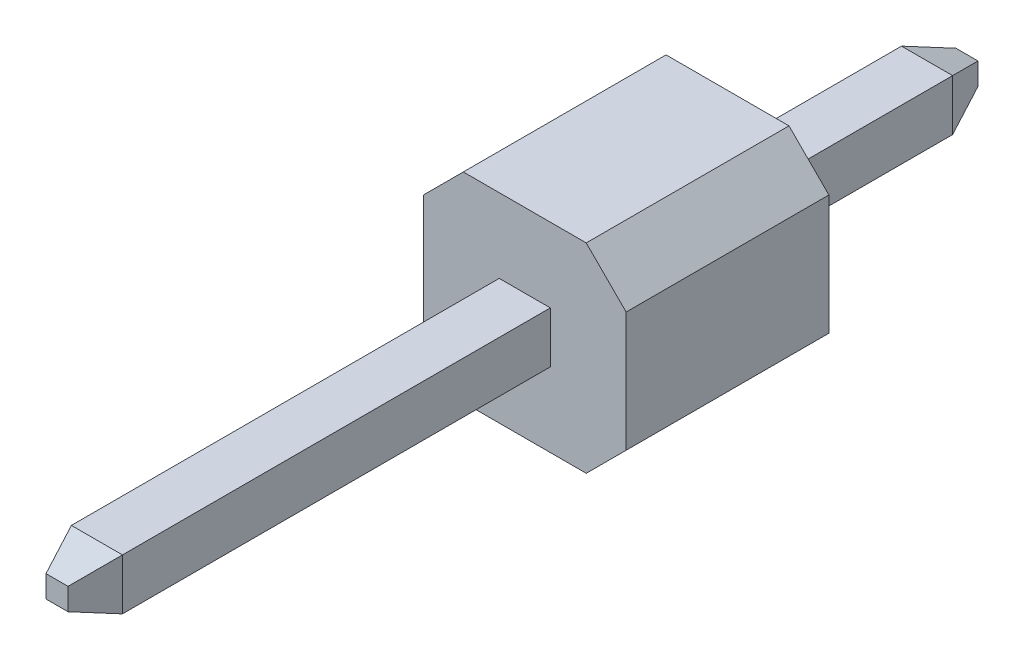
ISO-10303-21;
HEADER;
FILE_DESCRIPTION(('STEP AP214'),'2;1');
FILE_NAME('part.step','',(''),(''),'','','');
FILE_SCHEMA(('AUTOMOTIVE_DESIGN { 1 0 10303 214 1 1 1 1 }'));
ENDSEC;
DATA;
#1=APPLICATION_CONTEXT('core data for automotive mechanical design processes');
#2=APPLICATION_PROTOCOL_DEFINITION('international standard','automotive_design',2000,#1);
#3=PRODUCT_CONTEXT('',#1,'mechanical');
#4=PRODUCT('Part','Part','',(#3));
#5=PRODUCT_RELATED_PRODUCT_CATEGORY('part','',(#4));
#6=PRODUCT_DEFINITION_FORMATION('','',#4);
#7=PRODUCT_DEFINITION_CONTEXT('part definition',#1,'design');
#8=PRODUCT_DEFINITION('design','',#6,#7);
#9=PRODUCT_DEFINITION_SHAPE('','',#8);
#10=(LENGTH_UNIT() NAMED_UNIT(*) SI_UNIT(.MILLI.,.METRE.));
#11=(NAMED_UNIT(*) PLANE_ANGLE_UNIT() SI_UNIT($,.RADIAN.));
#12=(NAMED_UNIT(*) SI_UNIT($,.STERADIAN.) SOLID_ANGLE_UNIT());
#13=UNCERTAINTY_MEASURE_WITH_UNIT(LENGTH_MEASURE(1.E-05),#10,'distance_accuracy_value','');
#14=(GEOMETRIC_REPRESENTATION_CONTEXT(3) GLOBAL_UNCERTAINTY_ASSIGNED_CONTEXT((#13)) GLOBAL_UNIT_ASSIGNED_CONTEXT((#10,
#11,#12)) REPRESENTATION_CONTEXT('',''));
#15=CARTESIAN_POINT('',(0.,0.,0.));
#16=DIRECTION('',(0.,0.,1.));
#17=DIRECTION('',(1.,0.,0.));
#18=AXIS2_PLACEMENT_3D('',#15,#16,#17);
#19=CARTESIAN_POINT('',(-0.32,0.32,8.4));
#20=DIRECTION('',(1.,0.,0.));
#21=DIRECTION('',(0.,1.,0.));
#22=AXIS2_PLACEMENT_3D('',#19,#20,#21);
#23=PLANE('',#22);
#24=DIRECTION('',(0.,0.,-1.));
#25=VECTOR('',#24,1.);
#26=CARTESIAN_POINT('',(-0.32,0.32,8.4));
#27=LINE('',#26,#25);
#28=CARTESIAN_POINT('',(-0.32,0.32,7.9));
#29=VERTEX_POINT('',#28);
#30=CARTESIAN_POINT('',(-0.32,0.32,2.54));
#31=VERTEX_POINT('',#30);
#32=EDGE_CURVE('E183',#29,#31,#27,.T.);
#33=ORIENTED_EDGE('',*,*,#32,.T.);
#34=DIRECTION('',(0.,-1.,0.));
#35=VECTOR('',#34,1.);
#36=CARTESIAN_POINT('',(-0.32,0.32,2.54));
#37=LINE('',#36,#35);
#38=CARTESIAN_POINT('',(-0.32,-0.32,2.54));
#39=VERTEX_POINT('',#38);
#40=EDGE_CURVE('E281',#31,#39,#37,.T.);
#41=ORIENTED_EDGE('',*,*,#40,.T.);
#42=DIRECTION('',(0.,0.,-1.));
#43=VECTOR('',#42,1.);
#44=CARTESIAN_POINT('',(-0.32,-0.32,8.4));
#45=LINE('',#44,#43);
#46=CARTESIAN_POINT('',(-0.32,-0.32,7.9));
#47=VERTEX_POINT('',#46);
#48=EDGE_CURVE('E294',#47,#39,#45,.T.);
#49=ORIENTED_EDGE('',*,*,#48,.F.);
#50=DIRECTION('',(0.,1.,0.));
#51=VECTOR('',#50,1.);
#52=CARTESIAN_POINT('',(-0.32,0.32,7.9));
#53=LINE('',#52,#51);
#54=EDGE_CURVE('E309',#47,#29,#53,.T.);
#55=ORIENTED_EDGE('',*,*,#54,.T.);
#56=EDGE_LOOP('',(#33,#41,#49,#55));
#57=FACE_BOUND('',#56,.T.);
#58=ADVANCED_FACE('F34',(#57),#23,.F.);
#59=CARTESIAN_POINT('',(-0.32,-0.32,8.4));
#60=DIRECTION('',(0.,1.,0.));
#61=DIRECTION('',(0.,0.,1.));
#62=AXIS2_PLACEMENT_3D('',#59,#60,#61);
#63=PLANE('',#62);
#64=ORIENTED_EDGE('',*,*,#48,.T.);
#65=DIRECTION('',(1.,0.,0.));
#66=VECTOR('',#65,1.);
#67=CARTESIAN_POINT('',(-0.32,-0.32,2.54));
#68=LINE('',#67,#66);
#69=CARTESIAN_POINT('',(0.32,-0.32,2.54));
#70=VERTEX_POINT('',#69);
#71=EDGE_CURVE('E278',#39,#70,#68,.T.);
#72=ORIENTED_EDGE('',*,*,#71,.T.);
#73=DIRECTION('',(0.,0.,-1.));
#74=VECTOR('',#73,1.);
#75=CARTESIAN_POINT('',(0.32,-0.32,8.4));
#76=LINE('',#75,#74);
#77=CARTESIAN_POINT('',(0.32,-0.32,7.9));
#78=VERTEX_POINT('',#77);
#79=EDGE_CURVE('E291',#78,#70,#76,.T.);
#80=ORIENTED_EDGE('',*,*,#79,.F.);
#81=DIRECTION('',(-1.,0.,0.));
#82=VECTOR('',#81,1.);
#83=CARTESIAN_POINT('',(-0.32,-0.32,7.9));
#84=LINE('',#83,#82);
#85=EDGE_CURVE('E319',#78,#47,#84,.T.);
#86=ORIENTED_EDGE('',*,*,#85,.T.);
#87=EDGE_LOOP('',(#64,#72,#80,#86));
#88=FACE_BOUND('',#87,.T.);
#89=ADVANCED_FACE('F368',(#88),#63,.F.);
#90=CARTESIAN_POINT('',(0.32,0.32,8.4));
#91=DIRECTION('',(-1.,0.,0.));
#92=DIRECTION('',(0.,0.,1.));
#93=AXIS2_PLACEMENT_3D('',#90,#91,#92);
#94=PLANE('',#93);
#95=ORIENTED_EDGE('',*,*,#79,.T.);
#96=DIRECTION('',(0.,1.,0.));
#97=VECTOR('',#96,1.);
#98=CARTESIAN_POINT('',(0.32,0.32,2.54));
#99=LINE('',#98,#97);
#100=CARTESIAN_POINT('',(0.32,0.32,2.54));
#101=VERTEX_POINT('',#100);
#102=EDGE_CURVE('E193',#70,#101,#99,.T.);
#103=ORIENTED_EDGE('',*,*,#102,.T.);
#104=DIRECTION('',(0.,0.,-1.));
#105=VECTOR('',#104,1.);
#106=CARTESIAN_POINT('',(0.32,0.32,8.4));
#107=LINE('',#106,#105);
#108=CARTESIAN_POINT('',(0.32,0.32,7.9));
#109=VERTEX_POINT('',#108);
#110=EDGE_CURVE('E287',#109,#101,#107,.T.);
#111=ORIENTED_EDGE('',*,*,#110,.F.);
#112=DIRECTION('',(0.,-1.,0.));
#113=VECTOR('',#112,1.);
#114=CARTESIAN_POINT('',(0.32,-0.32,7.9));
#115=LINE('',#114,#113);
#116=EDGE_CURVE('E313',#109,#78,#115,.T.);
#117=ORIENTED_EDGE('',*,*,#116,.T.);
#118=EDGE_LOOP('',(#95,#103,#111,#117));
#119=FACE_BOUND('',#118,.T.);
#120=ADVANCED_FACE('F364',(#119),#94,.F.);
#121=CARTESIAN_POINT('',(-0.32,0.32,8.4));
#122=DIRECTION('',(0.,-1.,0.));
#123=DIRECTION('',(0.,0.,-1.));
#124=AXIS2_PLACEMENT_3D('',#121,#122,#123);
#125=PLANE('',#124);
#126=ORIENTED_EDGE('',*,*,#110,.T.);
#127=DIRECTION('',(-1.,0.,0.));
#128=VECTOR('',#127,1.);
#129=CARTESIAN_POINT('',(-0.32,0.32,2.54));
#130=LINE('',#129,#128);
#131=EDGE_CURVE('E199',#101,#31,#130,.T.);
#132=ORIENTED_EDGE('',*,*,#131,.T.);
#133=ORIENTED_EDGE('',*,*,#32,.F.);
#134=DIRECTION('',(1.,0.,0.));
#135=VECTOR('',#134,1.);
#136=CARTESIAN_POINT('',(0.32,0.32,7.9));
#137=LINE('',#136,#135);
#138=EDGE_CURVE('E306',#29,#109,#137,.T.);
#139=ORIENTED_EDGE('',*,*,#138,.T.);
#140=EDGE_LOOP('',(#126,#132,#133,#139));
#141=FACE_BOUND('',#140,.T.);
#142=ADVANCED_FACE('F361',(#141),#125,.F.);
#143=CARTESIAN_POINT('',(0.,0.,8.4));
#144=DIRECTION('',(0.,0.,1.));
#145=DIRECTION('',(1.,0.,0.));
#146=AXIS2_PLACEMENT_3D('',#143,#144,#145);
#147=PLANE('',#146);
#148=DIRECTION('',(1.,0.,0.));
#149=VECTOR('',#148,1.);
#150=CARTESIAN_POINT('',(0.32,-0.138014882866899,8.4));
#151=LINE('',#150,#149);
#152=CARTESIAN_POINT('',(-0.138014882866899,-0.138014882866899,8.4));
#153=VERTEX_POINT('',#152);
#154=CARTESIAN_POINT('',(0.138014882866899,-0.138014882866899,8.4));
#155=VERTEX_POINT('',#154);
#156=EDGE_CURVE('E324',#153,#155,#151,.T.);
#157=ORIENTED_EDGE('',*,*,#156,.T.);
#158=DIRECTION('',(0.,1.,0.));
#159=VECTOR('',#158,1.);
#160=CARTESIAN_POINT('',(0.138014882866899,0.32,8.4));
#161=LINE('',#160,#159);
#162=CARTESIAN_POINT('',(0.138014882866899,0.138014882866899,8.4));
#163=VERTEX_POINT('',#162);
#164=EDGE_CURVE('E200',#155,#163,#161,.T.);
#165=ORIENTED_EDGE('',*,*,#164,.T.);
#166=DIRECTION('',(-1.,0.,0.));
#167=VECTOR('',#166,1.);
#168=CARTESIAN_POINT('',(-0.32,0.138014882866899,8.4));
#169=LINE('',#168,#167);
#170=CARTESIAN_POINT('',(-0.138014882866899,0.138014882866899,8.4));
#171=VERTEX_POINT('',#170);
#172=EDGE_CURVE('E206',#163,#171,#169,.T.);
#173=ORIENTED_EDGE('',*,*,#172,.T.);
#174=DIRECTION('',(0.,-1.,0.));
#175=VECTOR('',#174,1.);
#176=CARTESIAN_POINT('',(-0.138014882866899,-0.32,8.4));
#177=LINE('',#176,#175);
#178=EDGE_CURVE('E326',#171,#153,#177,.T.);
#179=ORIENTED_EDGE('',*,*,#178,.T.);
#180=EDGE_LOOP('',(#157,#165,#173,#179));
#181=FACE_BOUND('',#180,.T.);
#182=ADVANCED_FACE('F429',(#181),#147,.T.);
#183=CARTESIAN_POINT('',(-0.138014882866899,0.,8.4));
#184=DIRECTION('',(-0.939692620785909,0.,0.342020143325666));
#185=DIRECTION('',(0.,1.,0.));
#186=AXIS2_PLACEMENT_3D('',#183,#184,#185);
#187=PLANE('',#186);
#188=DIRECTION('',(-0.323615577118182,0.323615577118182,-0.88912649071599));
#189=VECTOR('',#188,1.);
#190=CARTESIAN_POINT('',(-0.123560992466288,0.123560992466288,8.43971173749895));
#191=LINE('',#190,#189);
#192=EDGE_CURVE('E340',#29,#171,#191,.F.);
#193=ORIENTED_EDGE('',*,*,#192,.F.);
#194=ORIENTED_EDGE('',*,*,#54,.F.);
#195=DIRECTION('',(-0.323615577118182,-0.323615577118182,-0.88912649071599));
#196=VECTOR('',#195,1.);
#197=CARTESIAN_POINT('',(-0.123560992466288,-0.123560992466288,8.43971173749895));
#198=LINE('',#197,#196);
#199=EDGE_CURVE('E209',#153,#47,#198,.T.);
#200=ORIENTED_EDGE('',*,*,#199,.F.);
#201=ORIENTED_EDGE('',*,*,#178,.F.);
#202=EDGE_LOOP('',(#193,#194,#200,#201));
#203=FACE_BOUND('',#202,.T.);
#204=ADVANCED_FACE('F356',(#203),#187,.T.);
#205=CARTESIAN_POINT('',(0.,-0.138014882866899,8.4));
#206=DIRECTION('',(0.,-0.939692620785909,0.342020143325666));
#207=DIRECTION('',(-1.,0.,0.));
#208=AXIS2_PLACEMENT_3D('',#205,#206,#207);
#209=PLANE('',#208);
#210=ORIENTED_EDGE('',*,*,#199,.T.);
#211=ORIENTED_EDGE('',*,*,#85,.F.);
#212=DIRECTION('',(-0.323615577118182,0.323615577118182,0.88912649071599));
#213=VECTOR('',#212,1.);
#214=CARTESIAN_POINT('',(0.123560992466288,-0.123560992466288,8.43971173749895));
#215=LINE('',#214,#213);
#216=EDGE_CURVE('E339',#155,#78,#215,.F.);
#217=ORIENTED_EDGE('',*,*,#216,.F.);
#218=ORIENTED_EDGE('',*,*,#156,.F.);
#219=EDGE_LOOP('',(#210,#211,#217,#218));
#220=FACE_BOUND('',#219,.T.);
#221=ADVANCED_FACE('F351',(#220),#209,.T.);
#222=CARTESIAN_POINT('',(0.,0.138014882866899,8.4));
#223=DIRECTION('',(0.,0.939692620785909,0.342020143325666));
#224=DIRECTION('',(1.,0.,0.));
#225=AXIS2_PLACEMENT_3D('',#222,#223,#224);
#226=PLANE('',#225);
#227=ORIENTED_EDGE('',*,*,#192,.T.);
#228=ORIENTED_EDGE('',*,*,#172,.F.);
#229=DIRECTION('',(0.323615577118182,0.323615577118182,-0.88912649071599));
#230=VECTOR('',#229,1.);
#231=CARTESIAN_POINT('',(0.123560992466288,0.123560992466288,8.43971173749895));
#232=LINE('',#231,#230);
#233=EDGE_CURVE('E283',#109,#163,#232,.F.);
#234=ORIENTED_EDGE('',*,*,#233,.F.);
#235=ORIENTED_EDGE('',*,*,#138,.F.);
#236=EDGE_LOOP('',(#227,#228,#234,#235));
#237=FACE_BOUND('',#236,.T.);
#238=ADVANCED_FACE('F421',(#237),#226,.T.);
#239=CARTESIAN_POINT('',(0.138014882866899,0.,8.4));
#240=DIRECTION('',(0.939692620785909,0.,0.342020143325666));
#241=DIRECTION('',(0.,-1.,0.));
#242=AXIS2_PLACEMENT_3D('',#239,#240,#241);
#243=PLANE('',#242);
#244=ORIENTED_EDGE('',*,*,#216,.T.);
#245=ORIENTED_EDGE('',*,*,#116,.F.);
#246=ORIENTED_EDGE('',*,*,#233,.T.);
#247=ORIENTED_EDGE('',*,*,#164,.F.);
#248=EDGE_LOOP('',(#244,#245,#246,#247));
#249=FACE_BOUND('',#248,.T.);
#250=ADVANCED_FACE('F418',(#249),#243,.T.);
#251=CARTESIAN_POINT('',(0.,0.,2.54));
#252=DIRECTION('',(0.,0.,1.));
#253=DIRECTION('',(1.,0.,0.));
#254=AXIS2_PLACEMENT_3D('',#251,#252,#253);
#255=PLANE('',#254);
#256=DIRECTION('',(0.,1.,0.));
#257=VECTOR('',#256,1.);
#258=CARTESIAN_POINT('',(1.27,1.25,2.54));
#259=LINE('',#258,#257);
#260=CARTESIAN_POINT('',(1.27,-0.749999999999998,2.54));
#261=VERTEX_POINT('',#260);
#262=CARTESIAN_POINT('',(1.27,0.75,2.54));
#263=VERTEX_POINT('',#262);
#264=EDGE_CURVE('E453',#261,#263,#259,.T.);
#265=ORIENTED_EDGE('',*,*,#264,.T.);
#266=DIRECTION('',(0.707106781186548,-0.707106781186548,0.));
#267=VECTOR('',#266,1.);
#268=CARTESIAN_POINT('',(1.01,1.01,2.54));
#269=LINE('',#268,#267);
#270=CARTESIAN_POINT('',(0.77,1.25,2.54));
#271=VERTEX_POINT('',#270);
#272=EDGE_CURVE('E234',#263,#271,#269,.F.);
#273=ORIENTED_EDGE('',*,*,#272,.T.);
#274=DIRECTION('',(-1.,0.,0.));
#275=VECTOR('',#274,1.);
#276=CARTESIAN_POINT('',(-1.27,1.25,2.54));
#277=LINE('',#276,#275);
#278=CARTESIAN_POINT('',(-0.769999999999998,1.25,2.54));
#279=VERTEX_POINT('',#278);
#280=EDGE_CURVE('E274',#271,#279,#277,.T.);
#281=ORIENTED_EDGE('',*,*,#280,.T.);
#282=DIRECTION('',(0.70710678118655,0.707106781186545,0.));
#283=VECTOR('',#282,1.);
#284=CARTESIAN_POINT('',(-1.01,1.01,2.54));
#285=LINE('',#284,#283);
#286=CARTESIAN_POINT('',(-1.27,0.750000000000001,2.54));
#287=VERTEX_POINT('',#286);
#288=EDGE_CURVE('E230',#279,#287,#285,.F.);
#289=ORIENTED_EDGE('',*,*,#288,.T.);
#290=DIRECTION('',(0.,-1.,0.));
#291=VECTOR('',#290,1.);
#292=CARTESIAN_POINT('',(-1.27,1.25,2.54));
#293=LINE('',#292,#291);
#294=CARTESIAN_POINT('',(-1.27,-0.749999999999996,2.54));
#295=VERTEX_POINT('',#294);
#296=EDGE_CURVE('E244',#287,#295,#293,.T.);
#297=ORIENTED_EDGE('',*,*,#296,.T.);
#298=DIRECTION('',(-0.707106781186546,0.707106781186549,0.));
#299=VECTOR('',#298,1.);
#300=CARTESIAN_POINT('',(-1.01,-1.01,2.54));
#301=LINE('',#300,#299);
#302=CARTESIAN_POINT('',(-0.769999999999998,-1.25,2.54));
#303=VERTEX_POINT('',#302);
#304=EDGE_CURVE('E56',#295,#303,#301,.F.);
#305=ORIENTED_EDGE('',*,*,#304,.T.);
#306=DIRECTION('',(1.,0.,0.));
#307=VECTOR('',#306,1.);
#308=CARTESIAN_POINT('',(-1.27,-1.25,2.54));
#309=LINE('',#308,#307);
#310=CARTESIAN_POINT('',(0.769999999999996,-1.25,2.54));
#311=VERTEX_POINT('',#310);
#312=EDGE_CURVE('E254',#303,#311,#309,.T.);
#313=ORIENTED_EDGE('',*,*,#312,.T.);
#314=DIRECTION('',(-0.707106781186549,-0.707106781186546,0.));
#315=VECTOR('',#314,1.);
#316=CARTESIAN_POINT('',(1.01,-1.01,2.54));
#317=LINE('',#316,#315);
#318=EDGE_CURVE('E232',#311,#261,#317,.F.);
#319=ORIENTED_EDGE('',*,*,#318,.T.);
#320=EDGE_LOOP('',(#265,#273,#281,#289,#297,#305,#313,#319));
#321=FACE_BOUND('',#320,.T.);
#322=ORIENTED_EDGE('',*,*,#40,.F.);
#323=ORIENTED_EDGE('',*,*,#131,.F.);
#324=ORIENTED_EDGE('',*,*,#102,.F.);
#325=ORIENTED_EDGE('',*,*,#71,.F.);
#326=EDGE_LOOP('',(#322,#323,#324,#325));
#327=FACE_BOUND('',#326,.T.);
#328=ADVANCED_FACE('F250',(#321,#327),#255,.T.);
#329=CARTESIAN_POINT('',(0.,0.,0.));
#330=DIRECTION('',(0.,0.,1.));
#331=DIRECTION('',(1.,0.,0.));
#332=AXIS2_PLACEMENT_3D('',#329,#330,#331);
#333=PLANE('',#332);
#334=DIRECTION('',(-1.,0.,0.));
#335=VECTOR('',#334,1.);
#336=CARTESIAN_POINT('',(-1.27,1.25,0.));
#337=LINE('',#336,#335);
#338=CARTESIAN_POINT('',(0.77,1.25,0.));
#339=VERTEX_POINT('',#338);
#340=CARTESIAN_POINT('',(-0.769999999999998,1.25,0.));
#341=VERTEX_POINT('',#340);
#342=EDGE_CURVE('E255',#339,#341,#337,.T.);
#343=ORIENTED_EDGE('',*,*,#342,.F.);
#344=DIRECTION('',(-0.707106781186548,0.707106781186548,0.));
#345=VECTOR('',#344,1.);
#346=CARTESIAN_POINT('',(0.77,1.25,0.));
#347=LINE('',#346,#345);
#348=CARTESIAN_POINT('',(1.27,0.75,0.));
#349=VERTEX_POINT('',#348);
#350=EDGE_CURVE('E222',#339,#349,#347,.F.);
#351=ORIENTED_EDGE('',*,*,#350,.T.);
#352=DIRECTION('',(0.,1.,0.));
#353=VECTOR('',#352,1.);
#354=CARTESIAN_POINT('',(1.27,1.25,0.));
#355=LINE('',#354,#353);
#356=CARTESIAN_POINT('',(1.27,-0.749999999999998,0.));
#357=VERTEX_POINT('',#356);
#358=EDGE_CURVE('E264',#357,#349,#355,.T.);
#359=ORIENTED_EDGE('',*,*,#358,.F.);
#360=DIRECTION('',(0.707106781186549,0.707106781186546,0.));
#361=VECTOR('',#360,1.);
#362=CARTESIAN_POINT('',(1.27,-0.749999999999998,0.));
#363=LINE('',#362,#361);
#364=CARTESIAN_POINT('',(0.769999999999996,-1.25,0.));
#365=VERTEX_POINT('',#364);
#366=EDGE_CURVE('E220',#357,#365,#363,.F.);
#367=ORIENTED_EDGE('',*,*,#366,.T.);
#368=DIRECTION('',(1.,0.,0.));
#369=VECTOR('',#368,1.);
#370=CARTESIAN_POINT('',(-1.27,-1.25,0.));
#371=LINE('',#370,#369);
#372=CARTESIAN_POINT('',(-0.769999999999998,-1.25,0.));
#373=VERTEX_POINT('',#372);
#374=EDGE_CURVE('E260',#373,#365,#371,.T.);
#375=ORIENTED_EDGE('',*,*,#374,.F.);
#376=DIRECTION('',(0.707106781186546,-0.707106781186549,0.));
#377=VECTOR('',#376,1.);
#378=CARTESIAN_POINT('',(-0.769999999999998,-1.25,0.));
#379=LINE('',#378,#377);
#380=CARTESIAN_POINT('',(-1.27,-0.749999999999996,0.));
#381=VERTEX_POINT('',#380);
#382=EDGE_CURVE('E216',#373,#381,#379,.F.);
#383=ORIENTED_EDGE('',*,*,#382,.T.);
#384=DIRECTION('',(0.,-1.,0.));
#385=VECTOR('',#384,1.);
#386=CARTESIAN_POINT('',(-1.27,1.25,0.));
#387=LINE('',#386,#385);
#388=CARTESIAN_POINT('',(-1.27,0.750000000000001,0.));
#389=VERTEX_POINT('',#388);
#390=EDGE_CURVE('E247',#389,#381,#387,.T.);
#391=ORIENTED_EDGE('',*,*,#390,.F.);
#392=DIRECTION('',(-0.70710678118655,-0.707106781186545,0.));
#393=VECTOR('',#392,1.);
#394=CARTESIAN_POINT('',(-1.27,0.750000000000001,0.));
#395=LINE('',#394,#393);
#396=EDGE_CURVE('E218',#389,#341,#395,.F.);
#397=ORIENTED_EDGE('',*,*,#396,.T.);
#398=EDGE_LOOP('',(#343,#351,#359,#367,#375,#383,#391,#397));
#399=FACE_BOUND('',#398,.T.);
#400=DIRECTION('',(-1.,0.,0.));
#401=VECTOR('',#400,1.);
#402=CARTESIAN_POINT('',(-0.32,0.32,0.));
#403=LINE('',#402,#401);
#404=CARTESIAN_POINT('',(0.32,0.32,0.));
#405=VERTEX_POINT('',#404);
#406=CARTESIAN_POINT('',(-0.32,0.32,0.));
#407=VERTEX_POINT('',#406);
#408=EDGE_CURVE('E176',#405,#407,#403,.T.);
#409=ORIENTED_EDGE('',*,*,#408,.T.);
#410=DIRECTION('',(0.,-1.,0.));
#411=VECTOR('',#410,1.);
#412=CARTESIAN_POINT('',(-0.32,0.32,0.));
#413=LINE('',#412,#411);
#414=CARTESIAN_POINT('',(-0.32,-0.32,0.));
#415=VERTEX_POINT('',#414);
#416=EDGE_CURVE('E188',#407,#415,#413,.T.);
#417=ORIENTED_EDGE('',*,*,#416,.T.);
#418=DIRECTION('',(1.,0.,0.));
#419=VECTOR('',#418,1.);
#420=CARTESIAN_POINT('',(-0.32,-0.32,0.));
#421=LINE('',#420,#419);
#422=CARTESIAN_POINT('',(0.32,-0.32,0.));
#423=VERTEX_POINT('',#422);
#424=EDGE_CURVE('E194',#415,#423,#421,.T.);
#425=ORIENTED_EDGE('',*,*,#424,.T.);
#426=DIRECTION('',(0.,1.,0.));
#427=VECTOR('',#426,1.);
#428=CARTESIAN_POINT('',(0.32,0.32,0.));
#429=LINE('',#428,#427);
#430=EDGE_CURVE('E198',#423,#405,#429,.T.);
#431=ORIENTED_EDGE('',*,*,#430,.T.);
#432=EDGE_LOOP('',(#409,#417,#425,#431));
#433=FACE_BOUND('',#432,.T.);
#434=ADVANCED_FACE('F197',(#399,#433),#333,.F.);
#435=CARTESIAN_POINT('',(-1.27,1.25,2.54));
#436=DIRECTION('',(1.,0.,0.));
#437=DIRECTION('',(0.,0.,-1.));
#438=AXIS2_PLACEMENT_3D('',#435,#436,#437);
#439=PLANE('',#438);
#440=ORIENTED_EDGE('',*,*,#296,.F.);
#441=DIRECTION('',(0.,0.,-1.));
#442=VECTOR('',#441,1.);
#443=CARTESIAN_POINT('',(-1.27,0.750000000000001,2.54));
#444=LINE('',#443,#442);
#445=EDGE_CURVE('E11',#287,#389,#444,.T.);
#446=ORIENTED_EDGE('',*,*,#445,.T.);
#447=ORIENTED_EDGE('',*,*,#390,.T.);
#448=DIRECTION('',(0.,0.,1.));
#449=VECTOR('',#448,1.);
#450=CARTESIAN_POINT('',(-1.27,-0.749999999999996,2.54));
#451=LINE('',#450,#449);
#452=EDGE_CURVE('E42',#381,#295,#451,.T.);
#453=ORIENTED_EDGE('',*,*,#452,.T.);
#454=EDGE_LOOP('',(#440,#446,#447,#453));
#455=FACE_BOUND('',#454,.T.);
#456=ADVANCED_FACE('F243',(#455),#439,.F.);
#457=CARTESIAN_POINT('',(-1.27,-1.25,2.54));
#458=DIRECTION('',(0.,1.,0.));
#459=DIRECTION('',(-1.,0.,0.));
#460=AXIS2_PLACEMENT_3D('',#457,#458,#459);
#461=PLANE('',#460);
#462=ORIENTED_EDGE('',*,*,#374,.T.);
#463=DIRECTION('',(0.,0.,1.));
#464=VECTOR('',#463,1.);
#465=CARTESIAN_POINT('',(0.769999999999996,-1.25,2.54));
#466=LINE('',#465,#464);
#467=EDGE_CURVE('E49',#365,#311,#466,.T.);
#468=ORIENTED_EDGE('',*,*,#467,.T.);
#469=ORIENTED_EDGE('',*,*,#312,.F.);
#470=DIRECTION('',(0.,0.,-1.));
#471=VECTOR('',#470,1.);
#472=CARTESIAN_POINT('',(-0.769999999999998,-1.25,2.54));
#473=LINE('',#472,#471);
#474=EDGE_CURVE('E236',#303,#373,#473,.T.);
#475=ORIENTED_EDGE('',*,*,#474,.T.);
#476=EDGE_LOOP('',(#462,#468,#469,#475));
#477=FACE_BOUND('',#476,.T.);
#478=ADVANCED_FACE('F259',(#477),#461,.F.);
#479=CARTESIAN_POINT('',(1.27,1.25,2.54));
#480=DIRECTION('',(-1.,0.,0.));
#481=DIRECTION('',(0.,0.,1.));
#482=AXIS2_PLACEMENT_3D('',#479,#480,#481);
#483=PLANE('',#482);
#484=ORIENTED_EDGE('',*,*,#358,.T.);
#485=DIRECTION('',(0.,0.,1.));
#486=VECTOR('',#485,1.);
#487=CARTESIAN_POINT('',(1.27,0.75,2.54));
#488=LINE('',#487,#486);
#489=EDGE_CURVE('E227',#349,#263,#488,.T.);
#490=ORIENTED_EDGE('',*,*,#489,.T.);
#491=ORIENTED_EDGE('',*,*,#264,.F.);
#492=DIRECTION('',(0.,0.,-1.));
#493=VECTOR('',#492,1.);
#494=CARTESIAN_POINT('',(1.27,-0.749999999999998,2.54));
#495=LINE('',#494,#493);
#496=EDGE_CURVE('E224',#261,#357,#495,.T.);
#497=ORIENTED_EDGE('',*,*,#496,.T.);
#498=EDGE_LOOP('',(#484,#490,#491,#497));
#499=FACE_BOUND('',#498,.T.);
#500=ADVANCED_FACE('F450',(#499),#483,.F.);
#501=CARTESIAN_POINT('',(-1.27,1.25,2.54));
#502=DIRECTION('',(0.,-1.,0.));
#503=DIRECTION('',(1.,0.,0.));
#504=AXIS2_PLACEMENT_3D('',#501,#502,#503);
#505=PLANE('',#504);
#506=ORIENTED_EDGE('',*,*,#280,.F.);
#507=DIRECTION('',(0.,0.,-1.));
#508=VECTOR('',#507,1.);
#509=CARTESIAN_POINT('',(0.77,1.25,2.54));
#510=LINE('',#509,#508);
#511=EDGE_CURVE('E213',#271,#339,#510,.T.);
#512=ORIENTED_EDGE('',*,*,#511,.T.);
#513=ORIENTED_EDGE('',*,*,#342,.T.);
#514=DIRECTION('',(0.,0.,1.));
#515=VECTOR('',#514,1.);
#516=CARTESIAN_POINT('',(-0.769999999999998,1.25,2.54));
#517=LINE('',#516,#515);
#518=EDGE_CURVE('E203',#341,#279,#517,.T.);
#519=ORIENTED_EDGE('',*,*,#518,.T.);
#520=EDGE_LOOP('',(#506,#512,#513,#519));
#521=FACE_BOUND('',#520,.T.);
#522=ADVANCED_FACE('F445',(#521),#505,.F.);
#523=CARTESIAN_POINT('',(0.,0.,-3.));
#524=DIRECTION('',(0.,0.,1.));
#525=DIRECTION('',(1.,0.,0.));
#526=AXIS2_PLACEMENT_3D('',#523,#524,#525);
#527=PLANE('',#526);
#528=DIRECTION('',(0.,1.,0.));
#529=VECTOR('',#528,1.);
#530=CARTESIAN_POINT('',(-0.138014882866899,0.,-3.));
#531=LINE('',#530,#529);
#532=CARTESIAN_POINT('',(-0.138014882866899,-0.138014882866899,-3.));
#533=VERTEX_POINT('',#532);
#534=CARTESIAN_POINT('',(-0.138014882866899,0.138014882866899,-3.));
#535=VERTEX_POINT('',#534);
#536=EDGE_CURVE('E301',#533,#535,#531,.T.);
#537=ORIENTED_EDGE('',*,*,#536,.T.);
#538=DIRECTION('',(1.,0.,0.));
#539=VECTOR('',#538,1.);
#540=CARTESIAN_POINT('',(0.,0.138014882866899,-3.));
#541=LINE('',#540,#539);
#542=CARTESIAN_POINT('',(0.138014882866899,0.138014882866899,-3.));
#543=VERTEX_POINT('',#542);
#544=EDGE_CURVE('E303',#535,#543,#541,.T.);
#545=ORIENTED_EDGE('',*,*,#544,.T.);
#546=DIRECTION('',(0.,-1.,0.));
#547=VECTOR('',#546,1.);
#548=CARTESIAN_POINT('',(0.138014882866899,0.,-3.));
#549=LINE('',#548,#547);
#550=CARTESIAN_POINT('',(0.138014882866899,-0.138014882866899,-3.));
#551=VERTEX_POINT('',#550);
#552=EDGE_CURVE('E299',#543,#551,#549,.T.);
#553=ORIENTED_EDGE('',*,*,#552,.T.);
#554=DIRECTION('',(-1.,0.,0.));
#555=VECTOR('',#554,1.);
#556=CARTESIAN_POINT('',(0.,-0.138014882866899,-3.));
#557=LINE('',#556,#555);
#558=EDGE_CURVE('E297',#551,#533,#557,.T.);
#559=ORIENTED_EDGE('',*,*,#558,.T.);
#560=EDGE_LOOP('',(#537,#545,#553,#559));
#561=FACE_BOUND('',#560,.T.);
#562=ADVANCED_FACE('F402',(#561),#527,.F.);
#563=CARTESIAN_POINT('',(-0.138014882866899,0.,-3.));
#564=DIRECTION('',(0.939692620785909,0.,0.342020143325667));
#565=DIRECTION('',(0.,1.,0.));
#566=AXIS2_PLACEMENT_3D('',#563,#564,#565);
#567=PLANE('',#566);
#568=DIRECTION('',(0.323615577118184,0.323615577118184,-0.889126490715989));
#569=VECTOR('',#568,1.);
#570=CARTESIAN_POINT('',(-0.123560992466288,-0.123560992466288,-3.03971173749895));
#571=LINE('',#570,#569);
#572=CARTESIAN_POINT('',(-0.32,-0.32,-2.5));
#573=VERTEX_POINT('',#572);
#574=EDGE_CURVE('E184',#533,#573,#571,.F.);
#575=ORIENTED_EDGE('',*,*,#574,.T.);
#576=DIRECTION('',(0.,-1.,0.));
#577=VECTOR('',#576,1.);
#578=CARTESIAN_POINT('',(-0.32,0.32,-2.5));
#579=LINE('',#578,#577);
#580=CARTESIAN_POINT('',(-0.32,0.32,-2.5));
#581=VERTEX_POINT('',#580);
#582=EDGE_CURVE('E311',#581,#573,#579,.T.);
#583=ORIENTED_EDGE('',*,*,#582,.F.);
#584=DIRECTION('',(0.323615577118184,-0.323615577118184,-0.889126490715989));
#585=VECTOR('',#584,1.);
#586=CARTESIAN_POINT('',(-0.123560992466288,0.123560992466288,-3.03971173749895));
#587=LINE('',#586,#585);
#588=EDGE_CURVE('E331',#535,#581,#587,.F.);
#589=ORIENTED_EDGE('',*,*,#588,.F.);
#590=ORIENTED_EDGE('',*,*,#536,.F.);
#591=EDGE_LOOP('',(#575,#583,#589,#590));
#592=FACE_BOUND('',#591,.T.);
#593=ADVANCED_FACE('F406',(#592),#567,.F.);
#594=CARTESIAN_POINT('',(0.,-0.138014882866899,-3.));
#595=DIRECTION('',(0.,0.939692620785909,0.342020143325667));
#596=DIRECTION('',(-1.,0.,0.));
#597=AXIS2_PLACEMENT_3D('',#594,#595,#596);
#598=PLANE('',#597);
#599=DIRECTION('',(0.323615577118184,-0.323615577118184,0.889126490715989));
#600=VECTOR('',#599,1.);
#601=CARTESIAN_POINT('',(0.123560992466288,-0.123560992466288,-3.03971173749895));
#602=LINE('',#601,#600);
#603=CARTESIAN_POINT('',(0.32,-0.32,-2.5));
#604=VERTEX_POINT('',#603);
#605=EDGE_CURVE('E333',#604,#551,#602,.F.);
#606=ORIENTED_EDGE('',*,*,#605,.F.);
#607=DIRECTION('',(1.,0.,0.));
#608=VECTOR('',#607,1.);
#609=CARTESIAN_POINT('',(-0.32,-0.32,-2.5));
#610=LINE('',#609,#608);
#611=EDGE_CURVE('E321',#573,#604,#610,.T.);
#612=ORIENTED_EDGE('',*,*,#611,.F.);
#613=ORIENTED_EDGE('',*,*,#574,.F.);
#614=ORIENTED_EDGE('',*,*,#558,.F.);
#615=EDGE_LOOP('',(#606,#612,#613,#614));
#616=FACE_BOUND('',#615,.T.);
#617=ADVANCED_FACE('F408',(#616),#598,.F.);
#618=CARTESIAN_POINT('',(0.138014882866899,0.,-3.));
#619=DIRECTION('',(-0.939692620785909,0.,0.342020143325667));
#620=DIRECTION('',(0.,-1.,0.));
#621=AXIS2_PLACEMENT_3D('',#618,#619,#620);
#622=PLANE('',#621);
#623=ORIENTED_EDGE('',*,*,#605,.T.);
#624=ORIENTED_EDGE('',*,*,#552,.F.);
#625=DIRECTION('',(0.323615577118184,0.323615577118184,0.889126490715989));
#626=VECTOR('',#625,1.);
#627=CARTESIAN_POINT('',(0.123560992466288,0.123560992466288,-3.03971173749895));
#628=LINE('',#627,#626);
#629=CARTESIAN_POINT('',(0.32,0.32,-2.5));
#630=VERTEX_POINT('',#629);
#631=EDGE_CURVE('E329',#630,#543,#628,.F.);
#632=ORIENTED_EDGE('',*,*,#631,.F.);
#633=DIRECTION('',(0.,1.,0.));
#634=VECTOR('',#633,1.);
#635=CARTESIAN_POINT('',(0.32,0.32,-2.5));
#636=LINE('',#635,#634);
#637=EDGE_CURVE('E316',#604,#630,#636,.T.);
#638=ORIENTED_EDGE('',*,*,#637,.F.);
#639=EDGE_LOOP('',(#623,#624,#632,#638));
#640=FACE_BOUND('',#639,.T.);
#641=ADVANCED_FACE('F399',(#640),#622,.F.);
#642=CARTESIAN_POINT('',(0.,0.138014882866899,-3.));
#643=DIRECTION('',(0.,-0.939692620785909,0.342020143325667));
#644=DIRECTION('',(1.,0.,0.));
#645=AXIS2_PLACEMENT_3D('',#642,#643,#644);
#646=PLANE('',#645);
#647=ORIENTED_EDGE('',*,*,#588,.T.);
#648=DIRECTION('',(-1.,0.,0.));
#649=VECTOR('',#648,1.);
#650=CARTESIAN_POINT('',(-0.32,0.32,-2.5));
#651=LINE('',#650,#649);
#652=EDGE_CURVE('E179',#630,#581,#651,.T.);
#653=ORIENTED_EDGE('',*,*,#652,.F.);
#654=ORIENTED_EDGE('',*,*,#631,.T.);
#655=ORIENTED_EDGE('',*,*,#544,.F.);
#656=EDGE_LOOP('',(#647,#653,#654,#655));
#657=FACE_BOUND('',#656,.T.);
#658=ADVANCED_FACE('F394',(#657),#646,.F.);
#659=ORIENTED_EDGE('',*,*,#408,.F.);
#660=EDGE_CURVE('E286',#405,#630,#107,.T.);
#661=ORIENTED_EDGE('',*,*,#660,.T.);
#662=ORIENTED_EDGE('',*,*,#652,.T.);
#663=EDGE_CURVE('E172',#407,#581,#27,.T.);
#664=ORIENTED_EDGE('',*,*,#663,.F.);
#665=EDGE_LOOP('',(#659,#661,#662,#664));
#666=FACE_BOUND('',#665,.T.);
#667=ADVANCED_FACE('F174',(#666),#125,.F.);
#668=ORIENTED_EDGE('',*,*,#430,.F.);
#669=EDGE_CURVE('E290',#423,#604,#76,.T.);
#670=ORIENTED_EDGE('',*,*,#669,.T.);
#671=ORIENTED_EDGE('',*,*,#637,.T.);
#672=ORIENTED_EDGE('',*,*,#660,.F.);
#673=EDGE_LOOP('',(#668,#670,#671,#672));
#674=FACE_BOUND('',#673,.T.);
#675=ADVANCED_FACE('F377',(#674),#94,.F.);
#676=ORIENTED_EDGE('',*,*,#424,.F.);
#677=EDGE_CURVE('E190',#415,#573,#45,.T.);
#678=ORIENTED_EDGE('',*,*,#677,.T.);
#679=ORIENTED_EDGE('',*,*,#611,.T.);
#680=ORIENTED_EDGE('',*,*,#669,.F.);
#681=EDGE_LOOP('',(#676,#678,#679,#680));
#682=FACE_BOUND('',#681,.T.);
#683=ADVANCED_FACE('F371',(#682),#63,.F.);
#684=ORIENTED_EDGE('',*,*,#416,.F.);
#685=ORIENTED_EDGE('',*,*,#663,.T.);
#686=ORIENTED_EDGE('',*,*,#582,.T.);
#687=ORIENTED_EDGE('',*,*,#677,.F.);
#688=EDGE_LOOP('',(#684,#685,#686,#687));
#689=FACE_BOUND('',#688,.T.);
#690=ADVANCED_FACE('F189',(#689),#23,.F.);
#691=CARTESIAN_POINT('',(0.77,1.25,2.54));
#692=DIRECTION('',(-0.707106781186547,-0.707106781186547,0.));
#693=DIRECTION('',(0.,0.,-1.));
#694=AXIS2_PLACEMENT_3D('',#691,#692,#693);
#695=PLANE('',#694);
#696=ORIENTED_EDGE('',*,*,#272,.F.);
#697=ORIENTED_EDGE('',*,*,#489,.F.);
#698=ORIENTED_EDGE('',*,*,#350,.F.);
#699=ORIENTED_EDGE('',*,*,#511,.F.);
#700=EDGE_LOOP('',(#696,#697,#698,#699));
#701=FACE_BOUND('',#700,.T.);
#702=ADVANCED_FACE('F385',(#701),#695,.F.);
#703=CARTESIAN_POINT('',(1.27,-0.749999999999998,2.54));
#704=DIRECTION('',(-0.707106781186546,0.707106781186549,0.));
#705=DIRECTION('',(0.,0.,-1.));
#706=AXIS2_PLACEMENT_3D('',#703,#704,#705);
#707=PLANE('',#706);
#708=ORIENTED_EDGE('',*,*,#318,.F.);
#709=ORIENTED_EDGE('',*,*,#467,.F.);
#710=ORIENTED_EDGE('',*,*,#366,.F.);
#711=ORIENTED_EDGE('',*,*,#496,.F.);
#712=EDGE_LOOP('',(#708,#709,#710,#711));
#713=FACE_BOUND('',#712,.T.);
#714=ADVANCED_FACE('F432',(#713),#707,.F.);
#715=CARTESIAN_POINT('',(-1.27,0.750000000000001,2.54));
#716=DIRECTION('',(0.707106781186545,-0.70710678118655,0.));
#717=DIRECTION('',(0.,0.,-1.));
#718=AXIS2_PLACEMENT_3D('',#715,#716,#717);
#719=PLANE('',#718);
#720=ORIENTED_EDGE('',*,*,#288,.F.);
#721=ORIENTED_EDGE('',*,*,#518,.F.);
#722=ORIENTED_EDGE('',*,*,#396,.F.);
#723=ORIENTED_EDGE('',*,*,#445,.F.);
#724=EDGE_LOOP('',(#720,#721,#722,#723));
#725=FACE_BOUND('',#724,.T.);
#726=ADVANCED_FACE('F435',(#725),#719,.F.);
#727=CARTESIAN_POINT('',(-0.769999999999998,-1.25,2.54));
#728=DIRECTION('',(0.707106781186549,0.707106781186546,0.));
#729=DIRECTION('',(0.,0.,-1.));
#730=AXIS2_PLACEMENT_3D('',#727,#728,#729);
#731=PLANE('',#730);
#732=ORIENTED_EDGE('',*,*,#304,.F.);
#733=ORIENTED_EDGE('',*,*,#452,.F.);
#734=ORIENTED_EDGE('',*,*,#382,.F.);
#735=ORIENTED_EDGE('',*,*,#474,.F.);
#736=EDGE_LOOP('',(#732,#733,#734,#735));
#737=FACE_BOUND('',#736,.T.);
#738=ADVANCED_FACE('F36',(#737),#731,.F.);
#739=CLOSED_SHELL('',(#58,#89,#120,#142,#182,#204,#221,#238,#250,#328,#434,#456,#478,#500,#522,
#562,#593,#617,#641,#658,#667,#675,#683,#690,#702,#714,#726,#738));
#740=MANIFOLD_SOLID_BREP('B2',#739);
#741=ADVANCED_BREP_SHAPE_REPRESENTATION('',(#18,#740),#14);
#742=SHAPE_DEFINITION_REPRESENTATION(#9,#741);
ENDSEC;
END-ISO-10303-21;
